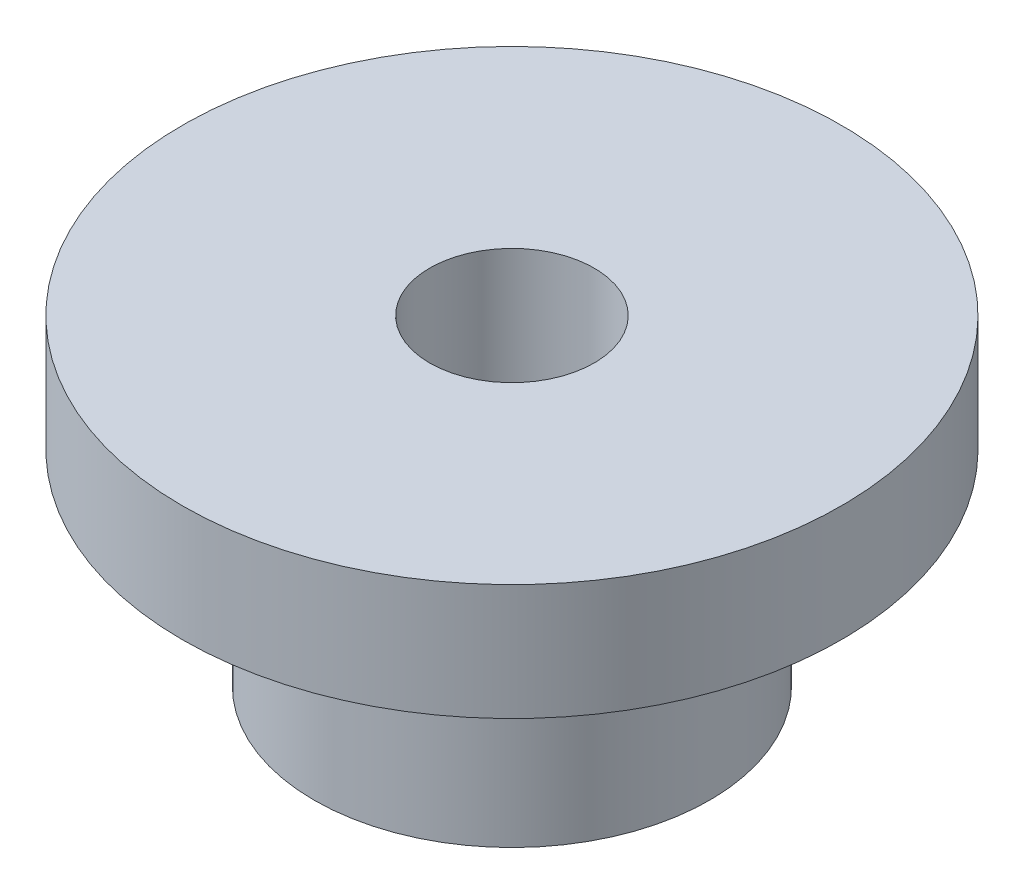
ISO-10303-21;
HEADER;
FILE_DESCRIPTION(('STEP AP214'),'2;1');
FILE_NAME('part.step','',(''),(''),'','','');
FILE_SCHEMA(('AUTOMOTIVE_DESIGN { 1 0 10303 214 1 1 1 1 }'));
ENDSEC;
DATA;
#1=APPLICATION_CONTEXT('core data for automotive mechanical design processes');
#2=APPLICATION_PROTOCOL_DEFINITION('international standard','automotive_design',2000,#1);
#3=PRODUCT_CONTEXT('',#1,'mechanical');
#4=PRODUCT('Part','Part','',(#3));
#5=PRODUCT_RELATED_PRODUCT_CATEGORY('part','',(#4));
#6=PRODUCT_DEFINITION_FORMATION('','',#4);
#7=PRODUCT_DEFINITION_CONTEXT('part definition',#1,'design');
#8=PRODUCT_DEFINITION('design','',#6,#7);
#9=PRODUCT_DEFINITION_SHAPE('','',#8);
#10=(LENGTH_UNIT() NAMED_UNIT(*) SI_UNIT(.MILLI.,.METRE.));
#11=(NAMED_UNIT(*) PLANE_ANGLE_UNIT() SI_UNIT($,.RADIAN.));
#12=(NAMED_UNIT(*) SI_UNIT($,.STERADIAN.) SOLID_ANGLE_UNIT());
#13=UNCERTAINTY_MEASURE_WITH_UNIT(LENGTH_MEASURE(1.E-05),#10,'distance_accuracy_value','');
#14=(GEOMETRIC_REPRESENTATION_CONTEXT(3) GLOBAL_UNCERTAINTY_ASSIGNED_CONTEXT((#13)) GLOBAL_UNIT_ASSIGNED_CONTEXT((#10,
#11,#12)) REPRESENTATION_CONTEXT('',''));
#15=CARTESIAN_POINT('',(0.,0.,0.));
#16=DIRECTION('',(0.,0.,1.));
#17=DIRECTION('',(1.,0.,0.));
#18=AXIS2_PLACEMENT_3D('',#15,#16,#17);
#19=CARTESIAN_POINT('',(0.,0.,0.));
#20=DIRECTION('',(0.,1.,0.));
#21=DIRECTION('',(0.,0.,1.));
#22=AXIS2_PLACEMENT_3D('',#19,#20,#21);
#23=PLANE('',#22);
#24=CARTESIAN_POINT('',(0.,0.,0.));
#25=DIRECTION('',(0.,1.,0.));
#26=DIRECTION('',(0.,0.,1.));
#27=AXIS2_PLACEMENT_3D('',#24,#25,#26);
#28=CIRCLE('',#27,4.7625);
#29=CARTESIAN_POINT('',(0.,0.,4.7625));
#30=VERTEX_POINT('',#29);
#31=EDGE_CURVE('E365',#30,#30,#28,.T.);
#32=ORIENTED_EDGE('',*,*,#31,.F.);
#33=EDGE_LOOP('',(#32));
#34=FACE_BOUND('',#33,.T.);
#35=CARTESIAN_POINT('',(0.,0.,0.));
#36=DIRECTION('',(0.,1.,0.));
#37=DIRECTION('',(0.,0.,1.));
#38=AXIS2_PLACEMENT_3D('',#35,#36,#37);
#39=CIRCLE('',#38,1.9812);
#40=CARTESIAN_POINT('',(0.,0.,1.9812));
#41=VERTEX_POINT('',#40);
#42=EDGE_CURVE('E369',#41,#41,#39,.T.);
#43=ORIENTED_EDGE('',*,*,#42,.T.);
#44=EDGE_LOOP('',(#43));
#45=FACE_BOUND('',#44,.T.);
#46=ADVANCED_FACE('F358',(#34,#45),#23,.F.);
#47=CARTESIAN_POINT('',(0.,4.93522,0.));
#48=DIRECTION('',(0.,-1.,0.));
#49=DIRECTION('',(0.,0.,-1.));
#50=AXIS2_PLACEMENT_3D('',#47,#48,#49);
#51=CYLINDRICAL_SURFACE('',#50,4.7625);
#52=CARTESIAN_POINT('',(0.,4.93522,0.));
#53=DIRECTION('',(0.,1.,0.));
#54=DIRECTION('',(0.,0.,1.));
#55=AXIS2_PLACEMENT_3D('',#52,#53,#54);
#56=CIRCLE('',#55,4.7625);
#57=CARTESIAN_POINT('',(0.,4.93522,4.7625));
#58=VERTEX_POINT('',#57);
#59=EDGE_CURVE('E10',#58,#58,#56,.T.);
#60=ORIENTED_EDGE('',*,*,#59,.F.);
#61=EDGE_LOOP('',(#60));
#62=FACE_BOUND('',#61,.T.);
#63=ORIENTED_EDGE('',*,*,#31,.T.);
#64=EDGE_LOOP('',(#63));
#65=FACE_BOUND('',#64,.T.);
#66=ADVANCED_FACE('F360',(#62,#65),#51,.T.);
#67=CARTESIAN_POINT('',(0.,4.93522,0.));
#68=DIRECTION('',(0.,-1.,0.));
#69=DIRECTION('',(0.,0.,-1.));
#70=AXIS2_PLACEMENT_3D('',#67,#68,#69);
#71=CYLINDRICAL_SURFACE('',#70,1.9812);
#72=ORIENTED_EDGE('',*,*,#42,.F.);
#73=EDGE_LOOP('',(#72));
#74=FACE_BOUND('',#73,.T.);
#75=CARTESIAN_POINT('',(0.,7.72922,0.));
#76=DIRECTION('',(0.,1.,0.));
#77=DIRECTION('',(0.,0.,1.));
#78=AXIS2_PLACEMENT_3D('',#75,#76,#77);
#79=CIRCLE('',#78,1.9812);
#80=CARTESIAN_POINT('',(0.,7.72922,1.9812));
#81=VERTEX_POINT('',#80);
#82=EDGE_CURVE('E381',#81,#81,#79,.T.);
#83=ORIENTED_EDGE('',*,*,#82,.T.);
#84=EDGE_LOOP('',(#83));
#85=FACE_BOUND('',#84,.T.);
#86=ADVANCED_FACE('F385',(#74,#85),#71,.F.);
#87=CARTESIAN_POINT('',(0.,4.93522,0.));
#88=DIRECTION('',(0.,1.,0.));
#89=DIRECTION('',(0.,0.,1.));
#90=AXIS2_PLACEMENT_3D('',#87,#88,#89);
#91=PLANE('',#90);
#92=CARTESIAN_POINT('',(0.,4.93522,0.));
#93=DIRECTION('',(0.,1.,0.));
#94=DIRECTION('',(0.,0.,1.));
#95=AXIS2_PLACEMENT_3D('',#92,#93,#94);
#96=CIRCLE('',#95,7.9375);
#97=CARTESIAN_POINT('',(0.,4.93522,7.9375));
#98=VERTEX_POINT('',#97);
#99=EDGE_CURVE('E378',#98,#98,#96,.T.);
#100=ORIENTED_EDGE('',*,*,#99,.F.);
#101=EDGE_LOOP('',(#100));
#102=FACE_BOUND('',#101,.T.);
#103=ORIENTED_EDGE('',*,*,#59,.T.);
#104=EDGE_LOOP('',(#103));
#105=FACE_BOUND('',#104,.T.);
#106=ADVANCED_FACE('F390',(#102,#105),#91,.F.);
#107=CARTESIAN_POINT('',(0.,7.72922,0.));
#108=DIRECTION('',(0.,1.,0.));
#109=DIRECTION('',(0.,0.,1.));
#110=AXIS2_PLACEMENT_3D('',#107,#108,#109);
#111=PLANE('',#110);
#112=CARTESIAN_POINT('',(0.,7.72922,0.));
#113=DIRECTION('',(0.,1.,0.));
#114=DIRECTION('',(0.,0.,1.));
#115=AXIS2_PLACEMENT_3D('',#112,#113,#114);
#116=CIRCLE('',#115,7.9375);
#117=CARTESIAN_POINT('',(0.,7.72922,7.9375));
#118=VERTEX_POINT('',#117);
#119=EDGE_CURVE('E373',#118,#118,#116,.T.);
#120=ORIENTED_EDGE('',*,*,#119,.T.);
#121=EDGE_LOOP('',(#120));
#122=FACE_BOUND('',#121,.T.);
#123=ORIENTED_EDGE('',*,*,#82,.F.);
#124=EDGE_LOOP('',(#123));
#125=FACE_BOUND('',#124,.T.);
#126=ADVANCED_FACE('F387',(#122,#125),#111,.T.);
#127=CARTESIAN_POINT('',(0.,7.72922,0.));
#128=DIRECTION('',(0.,-1.,0.));
#129=DIRECTION('',(0.,0.,-1.));
#130=AXIS2_PLACEMENT_3D('',#127,#128,#129);
#131=CYLINDRICAL_SURFACE('',#130,7.9375);
#132=ORIENTED_EDGE('',*,*,#119,.F.);
#133=EDGE_LOOP('',(#132));
#134=FACE_BOUND('',#133,.T.);
#135=ORIENTED_EDGE('',*,*,#99,.T.);
#136=EDGE_LOOP('',(#135));
#137=FACE_BOUND('',#136,.T.);
#138=ADVANCED_FACE('F389',(#134,#137),#131,.T.);
#139=CLOSED_SHELL('',(#46,#66,#86,#106,#126,#138));
#140=MANIFOLD_SOLID_BREP('B2',#139);
#141=ADVANCED_BREP_SHAPE_REPRESENTATION('',(#18,#140),#14);
#142=SHAPE_DEFINITION_REPRESENTATION(#9,#141);
ENDSEC;
END-ISO-10303-21;
